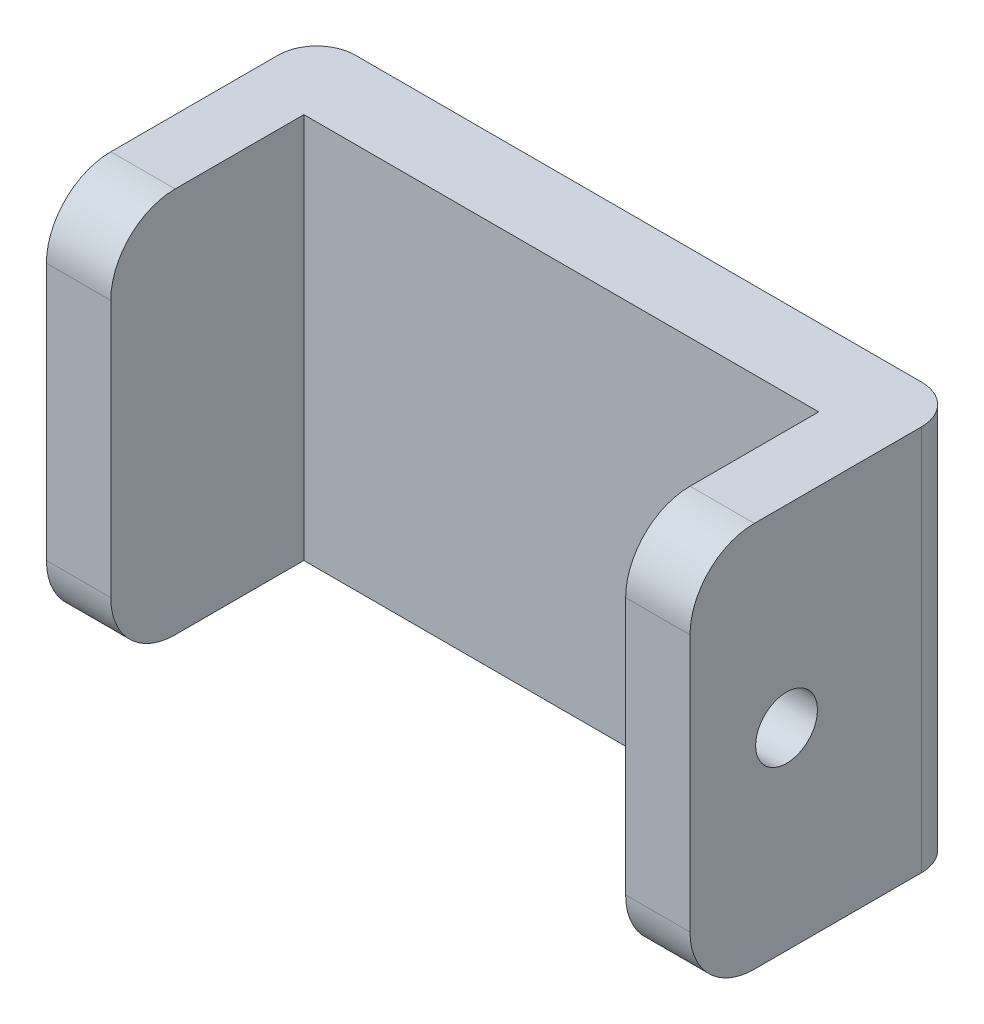
ISO-10303-21;
HEADER;
FILE_DESCRIPTION(('STEP AP214'),'2;1');
FILE_NAME('part.step','',(''),(''),'','','');
FILE_SCHEMA(('AUTOMOTIVE_DESIGN { 1 0 10303 214 1 1 1 1 }'));
ENDSEC;
DATA;
#1=APPLICATION_CONTEXT('core data for automotive mechanical design processes');
#2=APPLICATION_PROTOCOL_DEFINITION('international standard','automotive_design',2000,#1);
#3=PRODUCT_CONTEXT('',#1,'mechanical');
#4=PRODUCT('Part','Part','',(#3));
#5=PRODUCT_RELATED_PRODUCT_CATEGORY('part','',(#4));
#6=PRODUCT_DEFINITION_FORMATION('','',#4);
#7=PRODUCT_DEFINITION_CONTEXT('part definition',#1,'design');
#8=PRODUCT_DEFINITION('design','',#6,#7);
#9=PRODUCT_DEFINITION_SHAPE('','',#8);
#10=(LENGTH_UNIT() NAMED_UNIT(*) SI_UNIT(.MILLI.,.METRE.));
#11=(NAMED_UNIT(*) PLANE_ANGLE_UNIT() SI_UNIT($,.RADIAN.));
#12=(NAMED_UNIT(*) SI_UNIT($,.STERADIAN.) SOLID_ANGLE_UNIT());
#13=UNCERTAINTY_MEASURE_WITH_UNIT(LENGTH_MEASURE(1.E-05),#10,'distance_accuracy_value','');
#14=(GEOMETRIC_REPRESENTATION_CONTEXT(3) GLOBAL_UNCERTAINTY_ASSIGNED_CONTEXT((#13)) GLOBAL_UNIT_ASSIGNED_CONTEXT((#10,
#11,#12)) REPRESENTATION_CONTEXT('',''));
#15=CARTESIAN_POINT('',(0.,0.,0.));
#16=DIRECTION('',(0.,0.,1.));
#17=DIRECTION('',(1.,0.,0.));
#18=AXIS2_PLACEMENT_3D('',#15,#16,#17);
#19=CARTESIAN_POINT('',(0.,0.,6.));
#20=DIRECTION('',(0.,0.,1.));
#21=DIRECTION('',(1.,0.,0.));
#22=AXIS2_PLACEMENT_3D('',#19,#20,#21);
#23=PLANE('',#22);
#24=DIRECTION('',(-1.,0.,0.));
#25=VECTOR('',#24,1.);
#26=CARTESIAN_POINT('',(-286.5,-33.0000000000001,6.));
#27=LINE('',#26,#25);
#28=CARTESIAN_POINT('',(-241.5,-33.0000000000001,6.));
#29=VERTEX_POINT('',#28);
#30=CARTESIAN_POINT('',(-281.5,-33.0000000000001,6.));
#31=VERTEX_POINT('',#30);
#32=EDGE_CURVE('E158',#29,#31,#27,.T.);
#33=ORIENTED_EDGE('',*,*,#32,.T.);
#34=DIRECTION('',(0.,1.,0.));
#35=VECTOR('',#34,1.);
#36=CARTESIAN_POINT('',(-281.5,-63.0000000000001,6.));
#37=LINE('',#36,#35);
#38=CARTESIAN_POINT('',(-281.5,-63.0000000000001,6.));
#39=VERTEX_POINT('',#38);
#40=EDGE_CURVE('E157',#39,#31,#37,.T.);
#41=ORIENTED_EDGE('',*,*,#40,.F.);
#42=DIRECTION('',(1.,0.,0.));
#43=VECTOR('',#42,1.);
#44=CARTESIAN_POINT('',(-286.5,-63.0000000000001,6.));
#45=LINE('',#44,#43);
#46=CARTESIAN_POINT('',(-241.5,-63.0000000000001,6.));
#47=VERTEX_POINT('',#46);
#48=EDGE_CURVE('E141',#39,#47,#45,.T.);
#49=ORIENTED_EDGE('',*,*,#48,.T.);
#50=DIRECTION('',(0.,-1.,0.));
#51=VECTOR('',#50,1.);
#52=CARTESIAN_POINT('',(-241.5,-63.0000000000001,6.));
#53=LINE('',#52,#51);
#54=EDGE_CURVE('E154',#29,#47,#53,.T.);
#55=ORIENTED_EDGE('',*,*,#54,.F.);
#56=EDGE_LOOP('',(#33,#41,#49,#55));
#57=FACE_BOUND('',#56,.T.);
#58=ADVANCED_FACE('F35',(#57),#23,.T.);
#59=CARTESIAN_POINT('',(-286.5,-33.0000000000001,6.));
#60=DIRECTION('',(1.,0.,0.));
#61=DIRECTION('',(0.,0.,-1.));
#62=AXIS2_PLACEMENT_3D('',#59,#60,#61);
#63=PLANE('',#62);
#64=DIRECTION('',(0.,0.,-1.));
#65=VECTOR('',#64,1.);
#66=CARTESIAN_POINT('',(-286.5,-63.0000000000001,6.));
#67=LINE('',#66,#65);
#68=CARTESIAN_POINT('',(-286.5,-63.0000000000001,16.));
#69=VERTEX_POINT('',#68);
#70=CARTESIAN_POINT('',(-286.5,-63.0000000000001,3.));
#71=VERTEX_POINT('',#70);
#72=EDGE_CURVE('E185',#69,#71,#67,.T.);
#73=ORIENTED_EDGE('',*,*,#72,.F.);
#74=CARTESIAN_POINT('',(-286.5,-58.0000000000001,16.));
#75=DIRECTION('',(1.,0.,0.));
#76=DIRECTION('',(0.,0.,-1.));
#77=AXIS2_PLACEMENT_3D('',#74,#75,#76);
#78=CIRCLE('',#77,5.);
#79=CARTESIAN_POINT('',(-286.5,-58.0000000000001,21.));
#80=VERTEX_POINT('',#79);
#81=EDGE_CURVE('E11',#69,#80,#78,.F.);
#82=ORIENTED_EDGE('',*,*,#81,.T.);
#83=DIRECTION('',(0.,-1.,0.));
#84=VECTOR('',#83,1.);
#85=CARTESIAN_POINT('',(-286.5,-63.0000000000001,21.));
#86=LINE('',#85,#84);
#87=CARTESIAN_POINT('',(-286.5,-38.0000000000001,21.));
#88=VERTEX_POINT('',#87);
#89=EDGE_CURVE('E238',#88,#80,#86,.T.);
#90=ORIENTED_EDGE('',*,*,#89,.F.);
#91=CARTESIAN_POINT('',(-286.5,-38.0000000000001,16.));
#92=DIRECTION('',(1.,0.,0.));
#93=DIRECTION('',(0.,0.,-1.));
#94=AXIS2_PLACEMENT_3D('',#91,#92,#93);
#95=CIRCLE('',#94,5.);
#96=CARTESIAN_POINT('',(-286.5,-33.0000000000001,16.));
#97=VERTEX_POINT('',#96);
#98=EDGE_CURVE('E43',#88,#97,#95,.F.);
#99=ORIENTED_EDGE('',*,*,#98,.T.);
#100=DIRECTION('',(0.,0.,-1.));
#101=VECTOR('',#100,1.);
#102=CARTESIAN_POINT('',(-286.5,-33.0000000000001,6.));
#103=LINE('',#102,#101);
#104=CARTESIAN_POINT('',(-286.5,-33.0000000000001,3.));
#105=VERTEX_POINT('',#104);
#106=EDGE_CURVE('E175',#97,#105,#103,.T.);
#107=ORIENTED_EDGE('',*,*,#106,.T.);
#108=DIRECTION('',(0.,-1.,0.));
#109=VECTOR('',#108,1.);
#110=CARTESIAN_POINT('',(-286.5,-33.0000000000001,3.));
#111=LINE('',#110,#109);
#112=EDGE_CURVE('E187',#105,#71,#111,.T.);
#113=ORIENTED_EDGE('',*,*,#112,.T.);
#114=EDGE_LOOP('',(#73,#82,#90,#99,#107,#113));
#115=FACE_BOUND('',#114,.T.);
#116=ADVANCED_FACE('F237',(#115),#63,.F.);
#117=CARTESIAN_POINT('',(-286.5,-63.0000000000001,6.));
#118=DIRECTION('',(0.,1.,0.));
#119=DIRECTION('',(0.,0.,1.));
#120=AXIS2_PLACEMENT_3D('',#117,#118,#119);
#121=PLANE('',#120);
#122=DIRECTION('',(0.,0.,-1.));
#123=VECTOR('',#122,1.);
#124=CARTESIAN_POINT('',(-236.5,-63.0000000000001,6.));
#125=LINE('',#124,#123);
#126=CARTESIAN_POINT('',(-236.5,-63.0000000000001,16.));
#127=VERTEX_POINT('',#126);
#128=CARTESIAN_POINT('',(-236.5,-63.0000000000001,3.));
#129=VERTEX_POINT('',#128);
#130=EDGE_CURVE('E183',#127,#129,#125,.T.);
#131=ORIENTED_EDGE('',*,*,#130,.F.);
#132=DIRECTION('',(1.,0.,0.));
#133=VECTOR('',#132,1.);
#134=CARTESIAN_POINT('',(-241.5,-63.0000000000001,16.));
#135=LINE('',#134,#133);
#136=CARTESIAN_POINT('',(-241.5,-63.0000000000001,16.));
#137=VERTEX_POINT('',#136);
#138=EDGE_CURVE('E143',#127,#137,#135,.F.);
#139=ORIENTED_EDGE('',*,*,#138,.T.);
#140=DIRECTION('',(0.,0.,-1.));
#141=VECTOR('',#140,1.);
#142=CARTESIAN_POINT('',(-241.5,-63.0000000000001,21.));
#143=LINE('',#142,#141);
#144=EDGE_CURVE('E136',#137,#47,#143,.T.);
#145=ORIENTED_EDGE('',*,*,#144,.T.);
#146=ORIENTED_EDGE('',*,*,#48,.F.);
#147=DIRECTION('',(0.,0.,-1.));
#148=VECTOR('',#147,1.);
#149=CARTESIAN_POINT('',(-281.5,-63.0000000000001,21.));
#150=LINE('',#149,#148);
#151=CARTESIAN_POINT('',(-281.5,-63.0000000000001,16.));
#152=VERTEX_POINT('',#151);
#153=EDGE_CURVE('E164',#152,#39,#150,.T.);
#154=ORIENTED_EDGE('',*,*,#153,.F.);
#155=DIRECTION('',(1.,0.,0.));
#156=VECTOR('',#155,1.);
#157=CARTESIAN_POINT('',(-286.5,-63.0000000000001,16.));
#158=LINE('',#157,#156);
#159=EDGE_CURVE('E217',#152,#69,#158,.F.);
#160=ORIENTED_EDGE('',*,*,#159,.T.);
#161=ORIENTED_EDGE('',*,*,#72,.T.);
#162=CARTESIAN_POINT('',(-283.5,-63.0000000000001,3.));
#163=DIRECTION('',(0.,1.,0.));
#164=DIRECTION('',(0.,0.,1.));
#165=AXIS2_PLACEMENT_3D('',#162,#163,#164);
#166=CIRCLE('',#165,3.);
#167=CARTESIAN_POINT('',(-283.5,-63.0000000000001,0.));
#168=VERTEX_POINT('',#167);
#169=EDGE_CURVE('E193',#71,#168,#166,.F.);
#170=ORIENTED_EDGE('',*,*,#169,.T.);
#171=DIRECTION('',(1.,0.,0.));
#172=VECTOR('',#171,1.);
#173=CARTESIAN_POINT('',(-286.5,-63.0000000000001,0.));
#174=LINE('',#173,#172);
#175=CARTESIAN_POINT('',(-239.5,-63.0000000000001,0.));
#176=VERTEX_POINT('',#175);
#177=EDGE_CURVE('E172',#168,#176,#174,.T.);
#178=ORIENTED_EDGE('',*,*,#177,.T.);
#179=CARTESIAN_POINT('',(-239.5,-63.0000000000001,3.));
#180=DIRECTION('',(0.,1.,0.));
#181=DIRECTION('',(0.,0.,1.));
#182=AXIS2_PLACEMENT_3D('',#179,#180,#181);
#183=CIRCLE('',#182,3.);
#184=EDGE_CURVE('E190',#176,#129,#183,.F.);
#185=ORIENTED_EDGE('',*,*,#184,.T.);
#186=EDGE_LOOP('',(#131,#139,#145,#146,#154,#160,#161,#170,#178,#185));
#187=FACE_BOUND('',#186,.T.);
#188=ADVANCED_FACE('F139',(#187),#121,.F.);
#189=CARTESIAN_POINT('',(-236.5,-33.0000000000001,6.));
#190=DIRECTION('',(-1.,0.,0.));
#191=DIRECTION('',(0.,-1.,0.));
#192=AXIS2_PLACEMENT_3D('',#189,#190,#191);
#193=PLANE('',#192);
#194=CARTESIAN_POINT('',(-236.5,-48.0000000000001,13.5));
#195=DIRECTION('',(1.,0.,0.));
#196=DIRECTION('',(0.,1.,0.));
#197=AXIS2_PLACEMENT_3D('',#194,#195,#196);
#198=CIRCLE('',#197,2.4);
#199=CARTESIAN_POINT('',(-236.5,-45.6000000000001,13.5));
#200=VERTEX_POINT('',#199);
#201=EDGE_CURVE('E344',#200,#200,#198,.T.);
#202=ORIENTED_EDGE('',*,*,#201,.F.);
#203=EDGE_LOOP('',(#202));
#204=FACE_BOUND('',#203,.T.);
#205=DIRECTION('',(0.,1.,0.));
#206=VECTOR('',#205,1.);
#207=CARTESIAN_POINT('',(-236.5,-63.0000000000001,21.));
#208=LINE('',#207,#206);
#209=CARTESIAN_POINT('',(-236.5,-58.0000000000001,21.));
#210=VERTEX_POINT('',#209);
#211=CARTESIAN_POINT('',(-236.5,-38.0000000000001,21.));
#212=VERTEX_POINT('',#211);
#213=EDGE_CURVE('E163',#210,#212,#208,.T.);
#214=ORIENTED_EDGE('',*,*,#213,.F.);
#215=CARTESIAN_POINT('',(-236.5,-58.0000000000001,16.));
#216=DIRECTION('',(-1.,0.,0.));
#217=DIRECTION('',(0.,-1.,0.));
#218=AXIS2_PLACEMENT_3D('',#215,#216,#217);
#219=CIRCLE('',#218,5.);
#220=EDGE_CURVE('E215',#210,#127,#219,.F.);
#221=ORIENTED_EDGE('',*,*,#220,.T.);
#222=ORIENTED_EDGE('',*,*,#130,.T.);
#223=DIRECTION('',(0.,1.,0.));
#224=VECTOR('',#223,1.);
#225=CARTESIAN_POINT('',(-236.5,-33.0000000000001,3.));
#226=LINE('',#225,#224);
#227=CARTESIAN_POINT('',(-236.5,-33.0000000000001,3.));
#228=VERTEX_POINT('',#227);
#229=EDGE_CURVE('E204',#129,#228,#226,.T.);
#230=ORIENTED_EDGE('',*,*,#229,.T.);
#231=DIRECTION('',(0.,0.,-1.));
#232=VECTOR('',#231,1.);
#233=CARTESIAN_POINT('',(-236.5,-33.0000000000001,6.));
#234=LINE('',#233,#232);
#235=CARTESIAN_POINT('',(-236.5,-33.0000000000001,16.));
#236=VERTEX_POINT('',#235);
#237=EDGE_CURVE('E181',#236,#228,#234,.T.);
#238=ORIENTED_EDGE('',*,*,#237,.F.);
#239=CARTESIAN_POINT('',(-236.5,-38.0000000000001,16.));
#240=DIRECTION('',(-1.,0.,0.));
#241=DIRECTION('',(0.,-1.,0.));
#242=AXIS2_PLACEMENT_3D('',#239,#240,#241);
#243=CIRCLE('',#242,5.);
#244=EDGE_CURVE('E213',#236,#212,#243,.F.);
#245=ORIENTED_EDGE('',*,*,#244,.T.);
#246=EDGE_LOOP('',(#214,#221,#222,#230,#238,#245));
#247=FACE_BOUND('',#246,.T.);
#248=ADVANCED_FACE('F287',(#204,#247),#193,.F.);
#249=CARTESIAN_POINT('',(-286.5,-33.0000000000001,6.));
#250=DIRECTION('',(0.,-1.,0.));
#251=DIRECTION('',(0.,0.,-1.));
#252=AXIS2_PLACEMENT_3D('',#249,#250,#251);
#253=PLANE('',#252);
#254=DIRECTION('',(0.,0.,-1.));
#255=VECTOR('',#254,1.);
#256=CARTESIAN_POINT('',(-241.5,-33.0000000000001,21.));
#257=LINE('',#256,#255);
#258=CARTESIAN_POINT('',(-241.5,-33.0000000000001,16.));
#259=VERTEX_POINT('',#258);
#260=EDGE_CURVE('E147',#259,#29,#257,.T.);
#261=ORIENTED_EDGE('',*,*,#260,.F.);
#262=DIRECTION('',(-1.,0.,0.));
#263=VECTOR('',#262,1.);
#264=CARTESIAN_POINT('',(-236.5,-33.0000000000001,16.));
#265=LINE('',#264,#263);
#266=EDGE_CURVE('E226',#259,#236,#265,.F.);
#267=ORIENTED_EDGE('',*,*,#266,.T.);
#268=ORIENTED_EDGE('',*,*,#237,.T.);
#269=CARTESIAN_POINT('',(-239.5,-33.0000000000001,3.));
#270=DIRECTION('',(0.,-1.,0.));
#271=DIRECTION('',(0.,0.,-1.));
#272=AXIS2_PLACEMENT_3D('',#269,#270,#271);
#273=CIRCLE('',#272,3.);
#274=CARTESIAN_POINT('',(-239.5,-33.0000000000001,0.));
#275=VERTEX_POINT('',#274);
#276=EDGE_CURVE('E199',#228,#275,#273,.F.);
#277=ORIENTED_EDGE('',*,*,#276,.T.);
#278=DIRECTION('',(-1.,0.,0.));
#279=VECTOR('',#278,1.);
#280=CARTESIAN_POINT('',(-286.5,-33.0000000000001,0.));
#281=LINE('',#280,#279);
#282=CARTESIAN_POINT('',(-283.5,-33.0000000000001,0.));
#283=VERTEX_POINT('',#282);
#284=EDGE_CURVE('E159',#275,#283,#281,.T.);
#285=ORIENTED_EDGE('',*,*,#284,.T.);
#286=CARTESIAN_POINT('',(-283.5,-33.0000000000001,3.));
#287=DIRECTION('',(0.,-1.,0.));
#288=DIRECTION('',(0.,0.,-1.));
#289=AXIS2_PLACEMENT_3D('',#286,#287,#288);
#290=CIRCLE('',#289,3.);
#291=EDGE_CURVE('E201',#283,#105,#290,.F.);
#292=ORIENTED_EDGE('',*,*,#291,.T.);
#293=ORIENTED_EDGE('',*,*,#106,.F.);
#294=DIRECTION('',(-1.,0.,0.));
#295=VECTOR('',#294,1.);
#296=CARTESIAN_POINT('',(-281.5,-33.0000000000001,16.));
#297=LINE('',#296,#295);
#298=CARTESIAN_POINT('',(-281.5,-33.0000000000001,16.));
#299=VERTEX_POINT('',#298);
#300=EDGE_CURVE('E224',#97,#299,#297,.F.);
#301=ORIENTED_EDGE('',*,*,#300,.T.);
#302=DIRECTION('',(0.,0.,-1.));
#303=VECTOR('',#302,1.);
#304=CARTESIAN_POINT('',(-281.5,-33.0000000000001,21.));
#305=LINE('',#304,#303);
#306=EDGE_CURVE('E168',#299,#31,#305,.T.);
#307=ORIENTED_EDGE('',*,*,#306,.T.);
#308=ORIENTED_EDGE('',*,*,#32,.F.);
#309=EDGE_LOOP('',(#261,#267,#268,#277,#285,#292,#293,#301,#307,#308));
#310=FACE_BOUND('',#309,.T.);
#311=ADVANCED_FACE('F240',(#310),#253,.F.);
#312=CARTESIAN_POINT('',(0.,0.,0.));
#313=DIRECTION('',(0.,0.,1.));
#314=DIRECTION('',(1.,0.,0.));
#315=AXIS2_PLACEMENT_3D('',#312,#313,#314);
#316=PLANE('',#315);
#317=ORIENTED_EDGE('',*,*,#177,.F.);
#318=DIRECTION('',(0.,-1.,0.));
#319=VECTOR('',#318,1.);
#320=CARTESIAN_POINT('',(-283.5,0.,0.));
#321=LINE('',#320,#319);
#322=EDGE_CURVE('E197',#168,#283,#321,.F.);
#323=ORIENTED_EDGE('',*,*,#322,.T.);
#324=ORIENTED_EDGE('',*,*,#284,.F.);
#325=DIRECTION('',(0.,1.,0.));
#326=VECTOR('',#325,1.);
#327=CARTESIAN_POINT('',(-239.5,2.21582011998104E-13,0.));
#328=LINE('',#327,#326);
#329=EDGE_CURVE('E195',#275,#176,#328,.F.);
#330=ORIENTED_EDGE('',*,*,#329,.T.);
#331=EDGE_LOOP('',(#317,#323,#324,#330));
#332=FACE_BOUND('',#331,.T.);
#333=ADVANCED_FACE('F281',(#332),#316,.F.);
#334=CARTESIAN_POINT('',(-241.5,-63.0000000000001,21.));
#335=DIRECTION('',(1.,0.,0.));
#336=DIRECTION('',(0.,0.,-1.));
#337=AXIS2_PLACEMENT_3D('',#334,#335,#336);
#338=PLANE('',#337);
#339=CARTESIAN_POINT('',(-241.5,-48.0000000000001,13.5));
#340=DIRECTION('',(1.,0.,0.));
#341=DIRECTION('',(0.,0.,-1.));
#342=AXIS2_PLACEMENT_3D('',#339,#340,#341);
#343=CIRCLE('',#342,2.4);
#344=CARTESIAN_POINT('',(-241.5,-48.0000000000001,11.1));
#345=VERTEX_POINT('',#344);
#346=EDGE_CURVE('E255',#345,#345,#343,.F.);
#347=ORIENTED_EDGE('',*,*,#346,.F.);
#348=EDGE_LOOP('',(#347));
#349=FACE_BOUND('',#348,.T.);
#350=ORIENTED_EDGE('',*,*,#144,.F.);
#351=CARTESIAN_POINT('',(-241.5,-58.0000000000001,16.));
#352=DIRECTION('',(1.,0.,0.));
#353=DIRECTION('',(0.,0.,-1.));
#354=AXIS2_PLACEMENT_3D('',#351,#352,#353);
#355=CIRCLE('',#354,5.);
#356=CARTESIAN_POINT('',(-241.5,-58.0000000000001,21.));
#357=VERTEX_POINT('',#356);
#358=EDGE_CURVE('E222',#137,#357,#355,.F.);
#359=ORIENTED_EDGE('',*,*,#358,.T.);
#360=DIRECTION('',(0.,-1.,0.));
#361=VECTOR('',#360,1.);
#362=CARTESIAN_POINT('',(-241.5,-63.0000000000001,21.));
#363=LINE('',#362,#361);
#364=CARTESIAN_POINT('',(-241.5,-38.0000000000001,21.));
#365=VERTEX_POINT('',#364);
#366=EDGE_CURVE('E148',#365,#357,#363,.T.);
#367=ORIENTED_EDGE('',*,*,#366,.F.);
#368=CARTESIAN_POINT('',(-241.5,-38.0000000000001,16.));
#369=DIRECTION('',(1.,0.,0.));
#370=DIRECTION('',(0.,0.,-1.));
#371=AXIS2_PLACEMENT_3D('',#368,#369,#370);
#372=CIRCLE('',#371,5.);
#373=EDGE_CURVE('E220',#365,#259,#372,.F.);
#374=ORIENTED_EDGE('',*,*,#373,.T.);
#375=ORIENTED_EDGE('',*,*,#260,.T.);
#376=ORIENTED_EDGE('',*,*,#54,.T.);
#377=EDGE_LOOP('',(#350,#359,#367,#374,#375,#376));
#378=FACE_BOUND('',#377,.T.);
#379=ADVANCED_FACE('F161',(#349,#378),#338,.F.);
#380=CARTESIAN_POINT('',(0.,0.,21.));
#381=DIRECTION('',(0.,0.,1.));
#382=DIRECTION('',(1.,0.,0.));
#383=AXIS2_PLACEMENT_3D('',#380,#381,#382);
#384=PLANE('',#383);
#385=ORIENTED_EDGE('',*,*,#366,.T.);
#386=DIRECTION('',(1.,0.,0.));
#387=VECTOR('',#386,1.);
#388=CARTESIAN_POINT('',(-236.5,-58.0000000000001,21.));
#389=LINE('',#388,#387);
#390=EDGE_CURVE('E210',#357,#210,#389,.T.);
#391=ORIENTED_EDGE('',*,*,#390,.T.);
#392=ORIENTED_EDGE('',*,*,#213,.T.);
#393=DIRECTION('',(-1.,0.,0.));
#394=VECTOR('',#393,1.);
#395=CARTESIAN_POINT('',(-241.5,-38.0000000000001,21.));
#396=LINE('',#395,#394);
#397=EDGE_CURVE('E207',#212,#365,#396,.T.);
#398=ORIENTED_EDGE('',*,*,#397,.T.);
#399=EDGE_LOOP('',(#385,#391,#392,#398));
#400=FACE_BOUND('',#399,.T.);
#401=ADVANCED_FACE('F310',(#400),#384,.T.);
#402=CARTESIAN_POINT('',(-281.5,-63.0000000000001,21.));
#403=DIRECTION('',(-1.,0.,0.));
#404=DIRECTION('',(0.,-1.,0.));
#405=AXIS2_PLACEMENT_3D('',#402,#403,#404);
#406=PLANE('',#405);
#407=DIRECTION('',(0.,1.,0.));
#408=VECTOR('',#407,1.);
#409=CARTESIAN_POINT('',(-281.5,-63.0000000000001,21.));
#410=LINE('',#409,#408);
#411=CARTESIAN_POINT('',(-281.5,-58.0000000000001,21.));
#412=VERTEX_POINT('',#411);
#413=CARTESIAN_POINT('',(-281.5,-38.0000000000001,21.));
#414=VERTEX_POINT('',#413);
#415=EDGE_CURVE('E249',#412,#414,#410,.T.);
#416=ORIENTED_EDGE('',*,*,#415,.F.);
#417=CARTESIAN_POINT('',(-281.5,-58.0000000000001,16.));
#418=DIRECTION('',(-1.,0.,0.));
#419=DIRECTION('',(0.,-1.,0.));
#420=AXIS2_PLACEMENT_3D('',#417,#418,#419);
#421=CIRCLE('',#420,5.);
#422=EDGE_CURVE('E235',#412,#152,#421,.F.);
#423=ORIENTED_EDGE('',*,*,#422,.T.);
#424=ORIENTED_EDGE('',*,*,#153,.T.);
#425=ORIENTED_EDGE('',*,*,#40,.T.);
#426=ORIENTED_EDGE('',*,*,#306,.F.);
#427=CARTESIAN_POINT('',(-281.5,-38.0000000000001,16.));
#428=DIRECTION('',(-1.,0.,0.));
#429=DIRECTION('',(0.,-1.,0.));
#430=AXIS2_PLACEMENT_3D('',#427,#428,#429);
#431=CIRCLE('',#430,5.);
#432=EDGE_CURVE('E233',#299,#414,#431,.F.);
#433=ORIENTED_EDGE('',*,*,#432,.T.);
#434=EDGE_LOOP('',(#416,#423,#424,#425,#426,#433));
#435=FACE_BOUND('',#434,.T.);
#436=ADVANCED_FACE('F248',(#435),#406,.F.);
#437=CARTESIAN_POINT('',(0.,0.,21.));
#438=DIRECTION('',(0.,0.,1.));
#439=DIRECTION('',(1.,0.,0.));
#440=AXIS2_PLACEMENT_3D('',#437,#438,#439);
#441=PLANE('',#440);
#442=ORIENTED_EDGE('',*,*,#89,.T.);
#443=DIRECTION('',(1.,0.,0.));
#444=VECTOR('',#443,1.);
#445=CARTESIAN_POINT('',(-281.5,-58.0000000000001,21.));
#446=LINE('',#445,#444);
#447=EDGE_CURVE('E230',#80,#412,#446,.T.);
#448=ORIENTED_EDGE('',*,*,#447,.T.);
#449=ORIENTED_EDGE('',*,*,#415,.T.);
#450=DIRECTION('',(-1.,0.,0.));
#451=VECTOR('',#450,1.);
#452=CARTESIAN_POINT('',(-286.5,-38.0000000000001,21.));
#453=LINE('',#452,#451);
#454=EDGE_CURVE('E228',#414,#88,#453,.T.);
#455=ORIENTED_EDGE('',*,*,#454,.T.);
#456=EDGE_LOOP('',(#442,#448,#449,#455));
#457=FACE_BOUND('',#456,.T.);
#458=ADVANCED_FACE('F251',(#457),#441,.T.);
#459=CARTESIAN_POINT('',(-248.288225099391,-48.0000000000001,13.5));
#460=DIRECTION('',(1.,0.,0.));
#461=DIRECTION('',(0.,1.,0.));
#462=AXIS2_PLACEMENT_3D('',#459,#460,#461);
#463=CYLINDRICAL_SURFACE('',#462,2.4);
#464=ORIENTED_EDGE('',*,*,#346,.T.);
#465=EDGE_LOOP('',(#464));
#466=FACE_BOUND('',#465,.T.);
#467=ORIENTED_EDGE('',*,*,#201,.T.);
#468=EDGE_LOOP('',(#467));
#469=FACE_BOUND('',#468,.T.);
#470=ADVANCED_FACE('F297',(#466,#469),#463,.F.);
#471=CARTESIAN_POINT('',(-283.5,-33.0000000000001,3.));
#472=DIRECTION('',(0.,-1.,0.));
#473=DIRECTION('',(0.,0.,-1.));
#474=AXIS2_PLACEMENT_3D('',#471,#472,#473);
#475=CYLINDRICAL_SURFACE('',#474,3.);
#476=ORIENTED_EDGE('',*,*,#291,.F.);
#477=ORIENTED_EDGE('',*,*,#322,.F.);
#478=ORIENTED_EDGE('',*,*,#169,.F.);
#479=ORIENTED_EDGE('',*,*,#112,.F.);
#480=EDGE_LOOP('',(#476,#477,#478,#479));
#481=FACE_BOUND('',#480,.T.);
#482=ADVANCED_FACE('F293',(#481),#475,.T.);
#483=CARTESIAN_POINT('',(-239.5,-33.0000000000001,3.));
#484=DIRECTION('',(0.,1.,0.));
#485=DIRECTION('',(-1.,0.,0.));
#486=AXIS2_PLACEMENT_3D('',#483,#484,#485);
#487=CYLINDRICAL_SURFACE('',#486,3.);
#488=ORIENTED_EDGE('',*,*,#184,.F.);
#489=ORIENTED_EDGE('',*,*,#329,.F.);
#490=ORIENTED_EDGE('',*,*,#276,.F.);
#491=ORIENTED_EDGE('',*,*,#229,.F.);
#492=EDGE_LOOP('',(#488,#489,#490,#491));
#493=FACE_BOUND('',#492,.T.);
#494=ADVANCED_FACE('F296',(#493),#487,.T.);
#495=CARTESIAN_POINT('',(0.,-58.0000000000001,16.));
#496=DIRECTION('',(-1.,0.,0.));
#497=DIRECTION('',(0.,0.,1.));
#498=AXIS2_PLACEMENT_3D('',#495,#496,#497);
#499=CYLINDRICAL_SURFACE('',#498,5.);
#500=ORIENTED_EDGE('',*,*,#358,.F.);
#501=ORIENTED_EDGE('',*,*,#138,.F.);
#502=ORIENTED_EDGE('',*,*,#220,.F.);
#503=ORIENTED_EDGE('',*,*,#390,.F.);
#504=EDGE_LOOP('',(#500,#501,#502,#503));
#505=FACE_BOUND('',#504,.T.);
#506=ADVANCED_FACE('F269',(#505),#499,.T.);
#507=CARTESIAN_POINT('',(0.,-38.0000000000001,16.));
#508=DIRECTION('',(1.,0.,0.));
#509=DIRECTION('',(0.,0.,-1.));
#510=AXIS2_PLACEMENT_3D('',#507,#508,#509);
#511=CYLINDRICAL_SURFACE('',#510,5.);
#512=ORIENTED_EDGE('',*,*,#244,.F.);
#513=ORIENTED_EDGE('',*,*,#266,.F.);
#514=ORIENTED_EDGE('',*,*,#373,.F.);
#515=ORIENTED_EDGE('',*,*,#397,.F.);
#516=EDGE_LOOP('',(#512,#513,#514,#515));
#517=FACE_BOUND('',#516,.T.);
#518=ADVANCED_FACE('F264',(#517),#511,.T.);
#519=CARTESIAN_POINT('',(0.,-58.0000000000001,16.));
#520=DIRECTION('',(-1.,0.,0.));
#521=DIRECTION('',(0.,0.,1.));
#522=AXIS2_PLACEMENT_3D('',#519,#520,#521);
#523=CYLINDRICAL_SURFACE('',#522,5.);
#524=ORIENTED_EDGE('',*,*,#81,.F.);
#525=ORIENTED_EDGE('',*,*,#159,.F.);
#526=ORIENTED_EDGE('',*,*,#422,.F.);
#527=ORIENTED_EDGE('',*,*,#447,.F.);
#528=EDGE_LOOP('',(#524,#525,#526,#527));
#529=FACE_BOUND('',#528,.T.);
#530=ADVANCED_FACE('F262',(#529),#523,.T.);
#531=CARTESIAN_POINT('',(0.,-38.0000000000001,16.));
#532=DIRECTION('',(1.,0.,0.));
#533=DIRECTION('',(0.,0.,-1.));
#534=AXIS2_PLACEMENT_3D('',#531,#532,#533);
#535=CYLINDRICAL_SURFACE('',#534,5.);
#536=ORIENTED_EDGE('',*,*,#432,.F.);
#537=ORIENTED_EDGE('',*,*,#300,.F.);
#538=ORIENTED_EDGE('',*,*,#98,.F.);
#539=ORIENTED_EDGE('',*,*,#454,.F.);
#540=EDGE_LOOP('',(#536,#537,#538,#539));
#541=FACE_BOUND('',#540,.T.);
#542=ADVANCED_FACE('F37',(#541),#535,.T.);
#543=CLOSED_SHELL('',(#58,#116,#188,#248,#311,#333,#379,#401,#436,#458,#470,#482,#494,#506,#518,
#530,#542));
#544=MANIFOLD_SOLID_BREP('B2',#543);
#545=ADVANCED_BREP_SHAPE_REPRESENTATION('',(#18,#544),#14);
#546=SHAPE_DEFINITION_REPRESENTATION(#9,#545);
ENDSEC;
END-ISO-10303-21;
